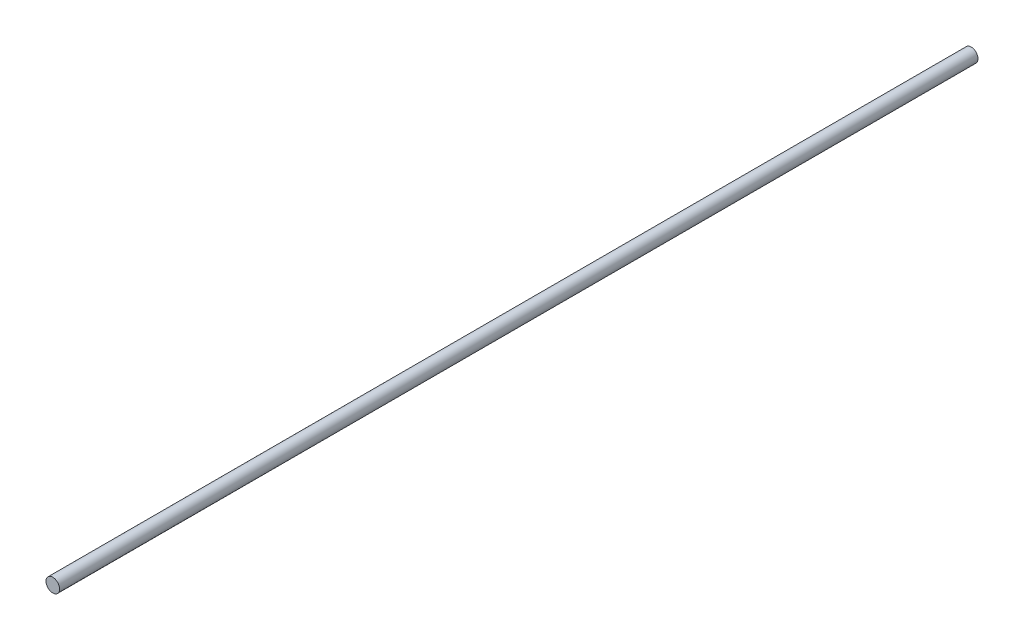
ISO-10303-21;
HEADER;
FILE_DESCRIPTION(('STEP AP214'),'2;1');
FILE_NAME('part.step','',(''),(''),'','','');
FILE_SCHEMA(('AUTOMOTIVE_DESIGN { 1 0 10303 214 1 1 1 1 }'));
ENDSEC;
DATA;
#1=APPLICATION_CONTEXT('core data for automotive mechanical design processes');
#2=APPLICATION_PROTOCOL_DEFINITION('international standard','automotive_design',2000,#1);
#3=PRODUCT_CONTEXT('',#1,'mechanical');
#4=PRODUCT('Part','Part','',(#3));
#5=PRODUCT_RELATED_PRODUCT_CATEGORY('part','',(#4));
#6=PRODUCT_DEFINITION_FORMATION('','',#4);
#7=PRODUCT_DEFINITION_CONTEXT('part definition',#1,'design');
#8=PRODUCT_DEFINITION('design','',#6,#7);
#9=PRODUCT_DEFINITION_SHAPE('','',#8);
#10=(LENGTH_UNIT() NAMED_UNIT(*) SI_UNIT(.MILLI.,.METRE.));
#11=(NAMED_UNIT(*) PLANE_ANGLE_UNIT() SI_UNIT($,.RADIAN.));
#12=(NAMED_UNIT(*) SI_UNIT($,.STERADIAN.) SOLID_ANGLE_UNIT());
#13=UNCERTAINTY_MEASURE_WITH_UNIT(LENGTH_MEASURE(1.E-05),#10,'distance_accuracy_value','');
#14=(GEOMETRIC_REPRESENTATION_CONTEXT(3) GLOBAL_UNCERTAINTY_ASSIGNED_CONTEXT((#13)) GLOBAL_UNIT_ASSIGNED_CONTEXT((#10,
#11,#12)) REPRESENTATION_CONTEXT('',''));
#15=CARTESIAN_POINT('',(0.,0.,0.));
#16=DIRECTION('',(0.,0.,1.));
#17=DIRECTION('',(1.,0.,0.));
#18=AXIS2_PLACEMENT_3D('',#15,#16,#17);
#19=CARTESIAN_POINT('',(0.,0.,540.));
#20=DIRECTION('',(0.,0.,-1.));
#21=DIRECTION('',(-1.,0.,0.));
#22=AXIS2_PLACEMENT_3D('',#19,#20,#21);
#23=CYLINDRICAL_SURFACE('',#22,4.);
#24=CARTESIAN_POINT('',(0.,0.,540.));
#25=DIRECTION('',(0.,0.,1.));
#26=DIRECTION('',(1.,0.,0.));
#27=AXIS2_PLACEMENT_3D('',#24,#25,#26);
#28=CIRCLE('',#27,4.);
#29=CARTESIAN_POINT('',(4.,0.,540.));
#30=VERTEX_POINT('',#29);
#31=EDGE_CURVE('E10',#30,#30,#28,.T.);
#32=ORIENTED_EDGE('',*,*,#31,.F.);
#33=EDGE_LOOP('',(#32));
#34=FACE_BOUND('',#33,.T.);
#35=CARTESIAN_POINT('',(0.,0.,0.));
#36=DIRECTION('',(0.,0.,1.));
#37=DIRECTION('',(1.,0.,0.));
#38=AXIS2_PLACEMENT_3D('',#35,#36,#37);
#39=CIRCLE('',#38,4.);
#40=CARTESIAN_POINT('',(4.,0.,0.));
#41=VERTEX_POINT('',#40);
#42=EDGE_CURVE('E34',#41,#41,#39,.T.);
#43=ORIENTED_EDGE('',*,*,#42,.T.);
#44=EDGE_LOOP('',(#43));
#45=FACE_BOUND('',#44,.T.);
#46=ADVANCED_FACE('F31',(#34,#45),#23,.T.);
#47=CARTESIAN_POINT('',(0.,0.,540.));
#48=DIRECTION('',(0.,0.,1.));
#49=DIRECTION('',(1.,0.,0.));
#50=AXIS2_PLACEMENT_3D('',#47,#48,#49);
#51=PLANE('',#50);
#52=ORIENTED_EDGE('',*,*,#31,.T.);
#53=EDGE_LOOP('',(#52));
#54=FACE_BOUND('',#53,.T.);
#55=ADVANCED_FACE('F46',(#54),#51,.T.);
#56=CARTESIAN_POINT('',(0.,0.,0.));
#57=DIRECTION('',(0.,0.,1.));
#58=DIRECTION('',(1.,0.,0.));
#59=AXIS2_PLACEMENT_3D('',#56,#57,#58);
#60=PLANE('',#59);
#61=ORIENTED_EDGE('',*,*,#42,.F.);
#62=EDGE_LOOP('',(#61));
#63=FACE_BOUND('',#62,.T.);
#64=ADVANCED_FACE('F44',(#63),#60,.F.);
#65=CLOSED_SHELL('',(#46,#55,#64));
#66=MANIFOLD_SOLID_BREP('B2',#65);
#67=ADVANCED_BREP_SHAPE_REPRESENTATION('',(#18,#66),#14);
#68=SHAPE_DEFINITION_REPRESENTATION(#9,#67);
ENDSEC;
END-ISO-10303-21;
